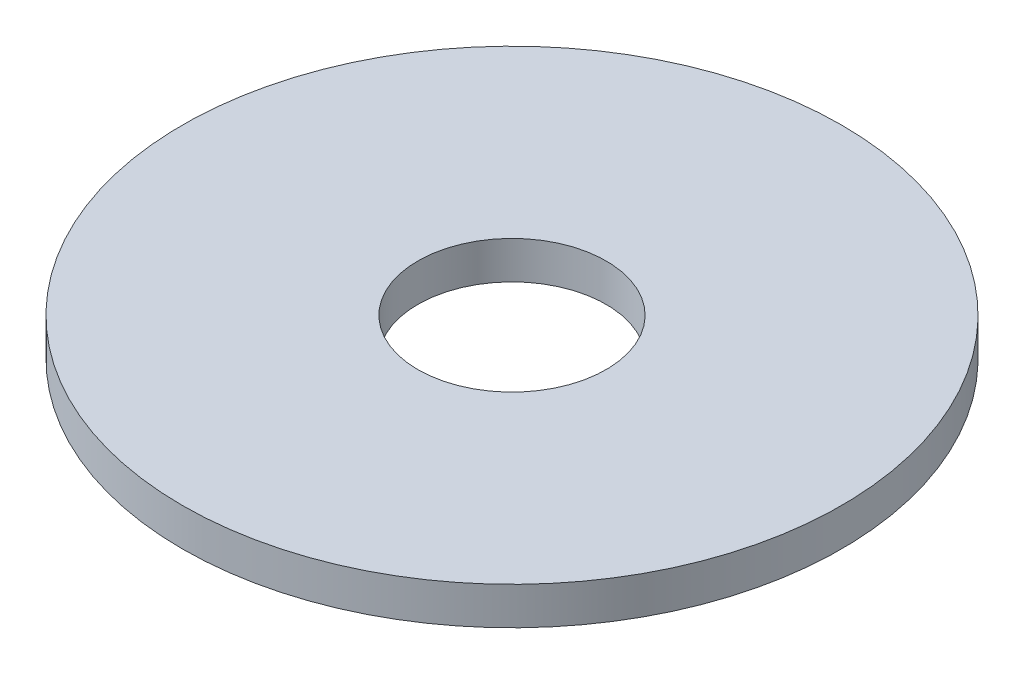
ISO-10303-21;
HEADER;
FILE_DESCRIPTION(('STEP AP214'),'2;1');
FILE_NAME('part.step','',(''),(''),'','','');
FILE_SCHEMA(('AUTOMOTIVE_DESIGN { 1 0 10303 214 1 1 1 1 }'));
ENDSEC;
DATA;
#1=APPLICATION_CONTEXT('core data for automotive mechanical design processes');
#2=APPLICATION_PROTOCOL_DEFINITION('international standard','automotive_design',2000,#1);
#3=PRODUCT_CONTEXT('',#1,'mechanical');
#4=PRODUCT('Part','Part','',(#3));
#5=PRODUCT_RELATED_PRODUCT_CATEGORY('part','',(#4));
#6=PRODUCT_DEFINITION_FORMATION('','',#4);
#7=PRODUCT_DEFINITION_CONTEXT('part definition',#1,'design');
#8=PRODUCT_DEFINITION('design','',#6,#7);
#9=PRODUCT_DEFINITION_SHAPE('','',#8);
#10=(LENGTH_UNIT() NAMED_UNIT(*) SI_UNIT(.MILLI.,.METRE.));
#11=(NAMED_UNIT(*) PLANE_ANGLE_UNIT() SI_UNIT($,.RADIAN.));
#12=(NAMED_UNIT(*) SI_UNIT($,.STERADIAN.) SOLID_ANGLE_UNIT());
#13=UNCERTAINTY_MEASURE_WITH_UNIT(LENGTH_MEASURE(1.E-05),#10,'distance_accuracy_value','');
#14=(GEOMETRIC_REPRESENTATION_CONTEXT(3) GLOBAL_UNCERTAINTY_ASSIGNED_CONTEXT((#13)) GLOBAL_UNIT_ASSIGNED_CONTEXT((#10,
#11,#12)) REPRESENTATION_CONTEXT('',''));
#15=CARTESIAN_POINT('',(0.,0.,0.));
#16=DIRECTION('',(0.,0.,1.));
#17=DIRECTION('',(1.,0.,0.));
#18=AXIS2_PLACEMENT_3D('',#15,#16,#17);
#19=CARTESIAN_POINT('',(0.,4.,0.));
#20=DIRECTION('',(0.,-1.,0.));
#21=DIRECTION('',(0.,0.,-1.));
#22=AXIS2_PLACEMENT_3D('',#19,#20,#21);
#23=CYLINDRICAL_SURFACE('',#22,35.);
#24=CARTESIAN_POINT('',(0.,4.,0.));
#25=DIRECTION('',(0.,1.,0.));
#26=DIRECTION('',(0.,0.,1.));
#27=AXIS2_PLACEMENT_3D('',#24,#25,#26);
#28=CIRCLE('',#27,35.);
#29=CARTESIAN_POINT('',(0.,4.,35.));
#30=VERTEX_POINT('',#29);
#31=EDGE_CURVE('E10',#30,#30,#28,.T.);
#32=ORIENTED_EDGE('',*,*,#31,.F.);
#33=EDGE_LOOP('',(#32));
#34=FACE_BOUND('',#33,.T.);
#35=CARTESIAN_POINT('',(0.,0.,0.));
#36=DIRECTION('',(0.,1.,0.));
#37=DIRECTION('',(0.,0.,1.));
#38=AXIS2_PLACEMENT_3D('',#35,#36,#37);
#39=CIRCLE('',#38,35.);
#40=CARTESIAN_POINT('',(0.,0.,35.));
#41=VERTEX_POINT('',#40);
#42=EDGE_CURVE('E37',#41,#41,#39,.T.);
#43=ORIENTED_EDGE('',*,*,#42,.T.);
#44=EDGE_LOOP('',(#43));
#45=FACE_BOUND('',#44,.T.);
#46=ADVANCED_FACE('F30',(#34,#45),#23,.T.);
#47=CARTESIAN_POINT('',(0.,4.,0.));
#48=DIRECTION('',(0.,1.,0.));
#49=DIRECTION('',(0.,0.,1.));
#50=AXIS2_PLACEMENT_3D('',#47,#48,#49);
#51=PLANE('',#50);
#52=CARTESIAN_POINT('',(0.,4.,0.));
#53=DIRECTION('',(0.,1.,0.));
#54=DIRECTION('',(0.,0.,1.));
#55=AXIS2_PLACEMENT_3D('',#52,#53,#54);
#56=CIRCLE('',#55,10.);
#57=CARTESIAN_POINT('',(0.,4.,10.));
#58=VERTEX_POINT('',#57);
#59=EDGE_CURVE('E43',#58,#58,#56,.T.);
#60=ORIENTED_EDGE('',*,*,#59,.F.);
#61=EDGE_LOOP('',(#60));
#62=FACE_BOUND('',#61,.T.);
#63=ORIENTED_EDGE('',*,*,#31,.T.);
#64=EDGE_LOOP('',(#63));
#65=FACE_BOUND('',#64,.T.);
#66=ADVANCED_FACE('F59',(#62,#65),#51,.T.);
#67=CARTESIAN_POINT('',(0.,0.,0.));
#68=DIRECTION('',(0.,1.,0.));
#69=DIRECTION('',(0.,0.,1.));
#70=AXIS2_PLACEMENT_3D('',#67,#68,#69);
#71=PLANE('',#70);
#72=CARTESIAN_POINT('',(0.,0.,0.));
#73=DIRECTION('',(0.,1.,0.));
#74=DIRECTION('',(0.,0.,1.));
#75=AXIS2_PLACEMENT_3D('',#72,#73,#74);
#76=CIRCLE('',#75,10.);
#77=CARTESIAN_POINT('',(0.,0.,10.));
#78=VERTEX_POINT('',#77);
#79=EDGE_CURVE('E33',#78,#78,#76,.T.);
#80=ORIENTED_EDGE('',*,*,#79,.T.);
#81=EDGE_LOOP('',(#80));
#82=FACE_BOUND('',#81,.T.);
#83=ORIENTED_EDGE('',*,*,#42,.F.);
#84=EDGE_LOOP('',(#83));
#85=FACE_BOUND('',#84,.T.);
#86=ADVANCED_FACE('F50',(#82,#85),#71,.F.);
#87=CARTESIAN_POINT('',(0.,-6.,0.));
#88=DIRECTION('',(0.,1.,0.));
#89=DIRECTION('',(0.,0.,1.));
#90=AXIS2_PLACEMENT_3D('',#87,#88,#89);
#91=CYLINDRICAL_SURFACE('',#90,10.);
#92=ORIENTED_EDGE('',*,*,#59,.T.);
#93=EDGE_LOOP('',(#92));
#94=FACE_BOUND('',#93,.T.);
#95=ORIENTED_EDGE('',*,*,#79,.F.);
#96=EDGE_LOOP('',(#95));
#97=FACE_BOUND('',#96,.T.);
#98=ADVANCED_FACE('F53',(#94,#97),#91,.F.);
#99=CLOSED_SHELL('',(#46,#66,#86,#98));
#100=MANIFOLD_SOLID_BREP('B2',#99);
#101=ADVANCED_BREP_SHAPE_REPRESENTATION('',(#18,#100),#14);
#102=SHAPE_DEFINITION_REPRESENTATION(#9,#101);
ENDSEC;
END-ISO-10303-21;
